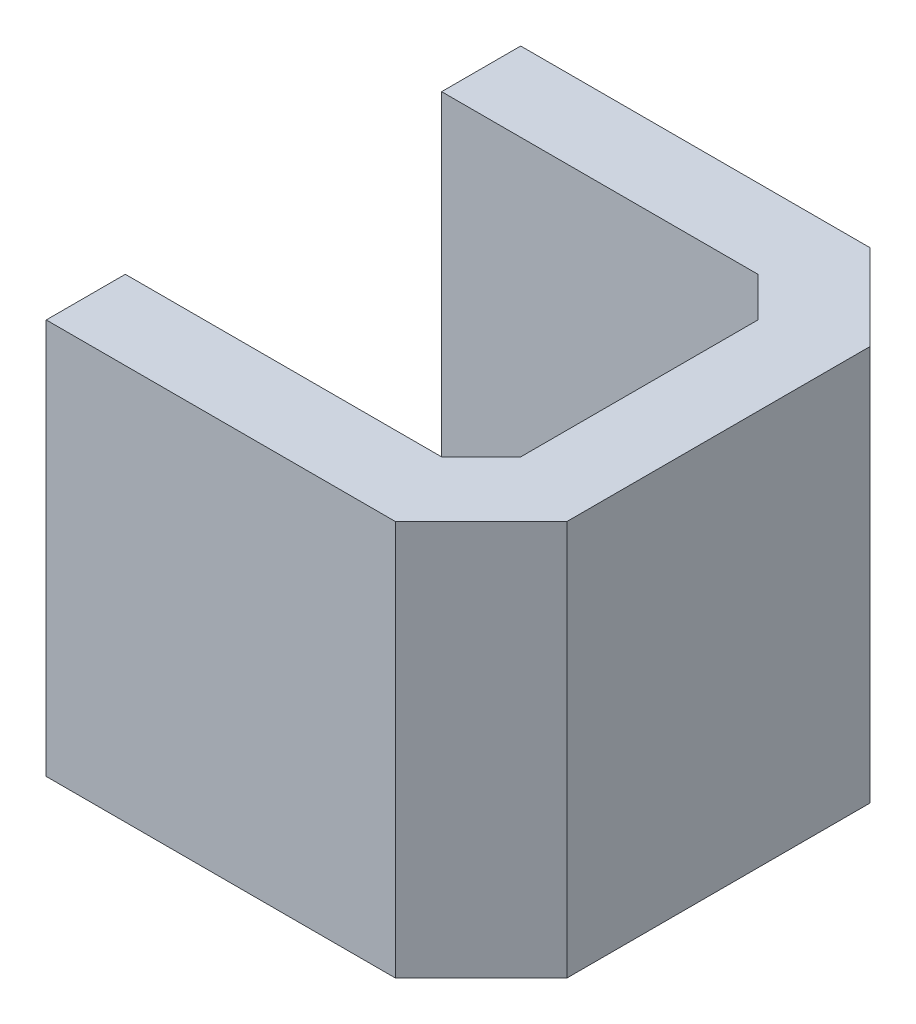
ISO-10303-21;
HEADER;
FILE_DESCRIPTION(('STEP AP214'),'2;1');
FILE_NAME('part.step','',(''),(''),'','','');
FILE_SCHEMA(('AUTOMOTIVE_DESIGN { 1 0 10303 214 1 1 1 1 }'));
ENDSEC;
DATA;
#1=APPLICATION_CONTEXT('core data for automotive mechanical design processes');
#2=APPLICATION_PROTOCOL_DEFINITION('international standard','automotive_design',2000,#1);
#3=PRODUCT_CONTEXT('',#1,'mechanical');
#4=PRODUCT('Part','Part','',(#3));
#5=PRODUCT_RELATED_PRODUCT_CATEGORY('part','',(#4));
#6=PRODUCT_DEFINITION_FORMATION('','',#4);
#7=PRODUCT_DEFINITION_CONTEXT('part definition',#1,'design');
#8=PRODUCT_DEFINITION('design','',#6,#7);
#9=PRODUCT_DEFINITION_SHAPE('','',#8);
#10=(LENGTH_UNIT() NAMED_UNIT(*) SI_UNIT(.MILLI.,.METRE.));
#11=(NAMED_UNIT(*) PLANE_ANGLE_UNIT() SI_UNIT($,.RADIAN.));
#12=(NAMED_UNIT(*) SI_UNIT($,.STERADIAN.) SOLID_ANGLE_UNIT());
#13=UNCERTAINTY_MEASURE_WITH_UNIT(LENGTH_MEASURE(1.E-05),#10,'distance_accuracy_value','');
#14=(GEOMETRIC_REPRESENTATION_CONTEXT(3) GLOBAL_UNCERTAINTY_ASSIGNED_CONTEXT((#13)) GLOBAL_UNIT_ASSIGNED_CONTEXT((#10,
#11,#12)) REPRESENTATION_CONTEXT('',''));
#15=CARTESIAN_POINT('',(0.,0.,0.));
#16=DIRECTION('',(0.,0.,1.));
#17=DIRECTION('',(1.,0.,0.));
#18=AXIS2_PLACEMENT_3D('',#15,#16,#17);
#19=CARTESIAN_POINT('',(5.,10.,3.));
#20=DIRECTION('',(0.707106781186548,0.,0.707106781186547));
#21=DIRECTION('',(0.707106781186547,0.,-0.707106781186548));
#22=AXIS2_PLACEMENT_3D('',#19,#20,#21);
#23=PLANE('',#22);
#24=DIRECTION('',(-0.707106781186547,0.,0.707106781186548));
#25=VECTOR('',#24,1.);
#26=CARTESIAN_POINT('',(5.,0.,3.));
#27=LINE('',#26,#25);
#28=CARTESIAN_POINT('',(5.,0.,3.));
#29=VERTEX_POINT('',#28);
#30=CARTESIAN_POINT('',(4.,0.,4.));
#31=VERTEX_POINT('',#30);
#32=EDGE_CURVE('E164',#29,#31,#27,.T.);
#33=ORIENTED_EDGE('',*,*,#32,.T.);
#34=DIRECTION('',(0.,-1.,0.));
#35=VECTOR('',#34,1.);
#36=CARTESIAN_POINT('',(4.,10.,4.));
#37=LINE('',#36,#35);
#38=CARTESIAN_POINT('',(4.,10.,4.));
#39=VERTEX_POINT('',#38);
#40=EDGE_CURVE('E11',#39,#31,#37,.T.);
#41=ORIENTED_EDGE('',*,*,#40,.F.);
#42=DIRECTION('',(-0.707106781186547,0.,0.707106781186548));
#43=VECTOR('',#42,1.);
#44=CARTESIAN_POINT('',(5.,10.,3.));
#45=LINE('',#44,#43);
#46=CARTESIAN_POINT('',(5.,10.,3.));
#47=VERTEX_POINT('',#46);
#48=EDGE_CURVE('E198',#47,#39,#45,.T.);
#49=ORIENTED_EDGE('',*,*,#48,.F.);
#50=DIRECTION('',(0.,-1.,0.));
#51=VECTOR('',#50,1.);
#52=CARTESIAN_POINT('',(5.,10.,3.));
#53=LINE('',#52,#51);
#54=EDGE_CURVE('E160',#47,#29,#53,.T.);
#55=ORIENTED_EDGE('',*,*,#54,.T.);
#56=EDGE_LOOP('',(#33,#41,#49,#55));
#57=FACE_BOUND('',#56,.T.);
#58=ADVANCED_FACE('F39',(#57),#23,.F.);
#59=CARTESIAN_POINT('',(-4.,10.,4.));
#60=DIRECTION('',(0.,0.,1.));
#61=DIRECTION('',(1.,0.,0.));
#62=AXIS2_PLACEMENT_3D('',#59,#60,#61);
#63=PLANE('',#62);
#64=DIRECTION('',(-1.,0.,0.));
#65=VECTOR('',#64,1.);
#66=CARTESIAN_POINT('',(-4.,0.,4.));
#67=LINE('',#66,#65);
#68=CARTESIAN_POINT('',(-4.,0.,4.));
#69=VERTEX_POINT('',#68);
#70=EDGE_CURVE('E168',#31,#69,#67,.T.);
#71=ORIENTED_EDGE('',*,*,#70,.T.);
#72=DIRECTION('',(0.,-1.,0.));
#73=VECTOR('',#72,1.);
#74=CARTESIAN_POINT('',(-4.,10.,4.));
#75=LINE('',#74,#73);
#76=CARTESIAN_POINT('',(-4.,10.,4.));
#77=VERTEX_POINT('',#76);
#78=EDGE_CURVE('E48',#77,#69,#75,.T.);
#79=ORIENTED_EDGE('',*,*,#78,.F.);
#80=DIRECTION('',(-1.,0.,0.));
#81=VECTOR('',#80,1.);
#82=CARTESIAN_POINT('',(-4.,10.,4.));
#83=LINE('',#82,#81);
#84=EDGE_CURVE('E111',#39,#77,#83,.T.);
#85=ORIENTED_EDGE('',*,*,#84,.F.);
#86=ORIENTED_EDGE('',*,*,#40,.T.);
#87=EDGE_LOOP('',(#71,#79,#85,#86));
#88=FACE_BOUND('',#87,.T.);
#89=ADVANCED_FACE('F292',(#88),#63,.F.);
#90=CARTESIAN_POINT('',(-4.,10.,4.));
#91=DIRECTION('',(1.,0.,0.));
#92=DIRECTION('',(0.,0.,-1.));
#93=AXIS2_PLACEMENT_3D('',#90,#91,#92);
#94=PLANE('',#93);
#95=DIRECTION('',(0.,0.,1.));
#96=VECTOR('',#95,1.);
#97=CARTESIAN_POINT('',(-4.,0.,4.));
#98=LINE('',#97,#96);
#99=CARTESIAN_POINT('',(-4.,0.,6.));
#100=VERTEX_POINT('',#99);
#101=EDGE_CURVE('E171',#69,#100,#98,.T.);
#102=ORIENTED_EDGE('',*,*,#101,.T.);
#103=DIRECTION('',(0.,-1.,0.));
#104=VECTOR('',#103,1.);
#105=CARTESIAN_POINT('',(-4.,10.,6.));
#106=LINE('',#105,#104);
#107=CARTESIAN_POINT('',(-4.,10.,6.));
#108=VERTEX_POINT('',#107);
#109=EDGE_CURVE('E225',#108,#100,#106,.T.);
#110=ORIENTED_EDGE('',*,*,#109,.F.);
#111=DIRECTION('',(0.,0.,1.));
#112=VECTOR('',#111,1.);
#113=CARTESIAN_POINT('',(-4.,10.,4.));
#114=LINE('',#113,#112);
#115=EDGE_CURVE('E235',#77,#108,#114,.T.);
#116=ORIENTED_EDGE('',*,*,#115,.F.);
#117=ORIENTED_EDGE('',*,*,#78,.T.);
#118=EDGE_LOOP('',(#102,#110,#116,#117));
#119=FACE_BOUND('',#118,.T.);
#120=ADVANCED_FACE('F233',(#119),#94,.F.);
#121=CARTESIAN_POINT('',(-4.,10.,6.));
#122=DIRECTION('',(0.,0.,-1.));
#123=DIRECTION('',(-1.,0.,0.));
#124=AXIS2_PLACEMENT_3D('',#121,#122,#123);
#125=PLANE('',#124);
#126=DIRECTION('',(1.,0.,0.));
#127=VECTOR('',#126,1.);
#128=CARTESIAN_POINT('',(-4.,0.,6.));
#129=LINE('',#128,#127);
#130=CARTESIAN_POINT('',(4.82842712474619,0.,6.));
#131=VERTEX_POINT('',#130);
#132=EDGE_CURVE('E174',#100,#131,#129,.T.);
#133=ORIENTED_EDGE('',*,*,#132,.T.);
#134=DIRECTION('',(0.,-1.,0.));
#135=VECTOR('',#134,1.);
#136=CARTESIAN_POINT('',(4.82842712474619,10.,6.));
#137=LINE('',#136,#135);
#138=CARTESIAN_POINT('',(4.82842712474619,10.,6.));
#139=VERTEX_POINT('',#138);
#140=EDGE_CURVE('E221',#139,#131,#137,.T.);
#141=ORIENTED_EDGE('',*,*,#140,.F.);
#142=DIRECTION('',(1.,0.,0.));
#143=VECTOR('',#142,1.);
#144=CARTESIAN_POINT('',(-4.,10.,6.));
#145=LINE('',#144,#143);
#146=EDGE_CURVE('E254',#108,#139,#145,.T.);
#147=ORIENTED_EDGE('',*,*,#146,.F.);
#148=ORIENTED_EDGE('',*,*,#109,.T.);
#149=EDGE_LOOP('',(#133,#141,#147,#148));
#150=FACE_BOUND('',#149,.T.);
#151=ADVANCED_FACE('F244',(#150),#125,.F.);
#152=CARTESIAN_POINT('',(7.,10.,3.82842712474619));
#153=DIRECTION('',(-0.707106781186548,0.,-0.707106781186547));
#154=DIRECTION('',(-0.707106781186547,0.,0.707106781186548));
#155=AXIS2_PLACEMENT_3D('',#152,#153,#154);
#156=PLANE('',#155);
#157=DIRECTION('',(0.707106781186547,0.,-0.707106781186548));
#158=VECTOR('',#157,1.);
#159=CARTESIAN_POINT('',(7.,0.,3.82842712474619));
#160=LINE('',#159,#158);
#161=CARTESIAN_POINT('',(7.,0.,3.82842712474619));
#162=VERTEX_POINT('',#161);
#163=EDGE_CURVE('E177',#131,#162,#160,.T.);
#164=ORIENTED_EDGE('',*,*,#163,.T.);
#165=DIRECTION('',(0.,-1.,0.));
#166=VECTOR('',#165,1.);
#167=CARTESIAN_POINT('',(7.,10.,3.82842712474619));
#168=LINE('',#167,#166);
#169=CARTESIAN_POINT('',(7.,10.,3.82842712474619));
#170=VERTEX_POINT('',#169);
#171=EDGE_CURVE('E217',#170,#162,#168,.T.);
#172=ORIENTED_EDGE('',*,*,#171,.F.);
#173=DIRECTION('',(0.707106781186547,0.,-0.707106781186548));
#174=VECTOR('',#173,1.);
#175=CARTESIAN_POINT('',(7.,10.,3.82842712474619));
#176=LINE('',#175,#174);
#177=EDGE_CURVE('E250',#139,#170,#176,.T.);
#178=ORIENTED_EDGE('',*,*,#177,.F.);
#179=ORIENTED_EDGE('',*,*,#140,.T.);
#180=EDGE_LOOP('',(#164,#172,#178,#179));
#181=FACE_BOUND('',#180,.T.);
#182=ADVANCED_FACE('F248',(#181),#156,.F.);
#183=CARTESIAN_POINT('',(7.,10.,-3.82842712474619));
#184=DIRECTION('',(-1.,0.,0.));
#185=DIRECTION('',(0.,0.,1.));
#186=AXIS2_PLACEMENT_3D('',#183,#184,#185);
#187=PLANE('',#186);
#188=DIRECTION('',(0.,0.,-1.));
#189=VECTOR('',#188,1.);
#190=CARTESIAN_POINT('',(7.,0.,-3.82842712474619));
#191=LINE('',#190,#189);
#192=CARTESIAN_POINT('',(7.,0.,-3.82842712474619));
#193=VERTEX_POINT('',#192);
#194=EDGE_CURVE('E180',#162,#193,#191,.T.);
#195=ORIENTED_EDGE('',*,*,#194,.T.);
#196=DIRECTION('',(0.,-1.,0.));
#197=VECTOR('',#196,1.);
#198=CARTESIAN_POINT('',(7.,10.,-3.82842712474619));
#199=LINE('',#198,#197);
#200=CARTESIAN_POINT('',(7.,10.,-3.82842712474619));
#201=VERTEX_POINT('',#200);
#202=EDGE_CURVE('E213',#201,#193,#199,.T.);
#203=ORIENTED_EDGE('',*,*,#202,.F.);
#204=DIRECTION('',(0.,0.,-1.));
#205=VECTOR('',#204,1.);
#206=CARTESIAN_POINT('',(7.,10.,-3.82842712474619));
#207=LINE('',#206,#205);
#208=EDGE_CURVE('E253',#170,#201,#207,.T.);
#209=ORIENTED_EDGE('',*,*,#208,.F.);
#210=ORIENTED_EDGE('',*,*,#171,.T.);
#211=EDGE_LOOP('',(#195,#203,#209,#210));
#212=FACE_BOUND('',#211,.T.);
#213=ADVANCED_FACE('F305',(#212),#187,.F.);
#214=CARTESIAN_POINT('',(4.82842712474619,10.,-6.));
#215=DIRECTION('',(-0.707106781186546,0.,0.707106781186549));
#216=DIRECTION('',(0.707106781186549,0.,0.707106781186546));
#217=AXIS2_PLACEMENT_3D('',#214,#215,#216);
#218=PLANE('',#217);
#219=DIRECTION('',(-0.707106781186549,0.,-0.707106781186546));
#220=VECTOR('',#219,1.);
#221=CARTESIAN_POINT('',(4.82842712474619,0.,-6.));
#222=LINE('',#221,#220);
#223=CARTESIAN_POINT('',(4.82842712474619,0.,-6.));
#224=VERTEX_POINT('',#223);
#225=EDGE_CURVE('E183',#193,#224,#222,.T.);
#226=ORIENTED_EDGE('',*,*,#225,.T.);
#227=DIRECTION('',(0.,-1.,0.));
#228=VECTOR('',#227,1.);
#229=CARTESIAN_POINT('',(4.82842712474619,10.,-6.));
#230=LINE('',#229,#228);
#231=CARTESIAN_POINT('',(4.82842712474619,10.,-6.));
#232=VERTEX_POINT('',#231);
#233=EDGE_CURVE('E209',#232,#224,#230,.T.);
#234=ORIENTED_EDGE('',*,*,#233,.F.);
#235=DIRECTION('',(-0.707106781186549,0.,-0.707106781186546));
#236=VECTOR('',#235,1.);
#237=CARTESIAN_POINT('',(4.82842712474619,10.,-6.));
#238=LINE('',#237,#236);
#239=EDGE_CURVE('E258',#201,#232,#238,.T.);
#240=ORIENTED_EDGE('',*,*,#239,.F.);
#241=ORIENTED_EDGE('',*,*,#202,.T.);
#242=EDGE_LOOP('',(#226,#234,#240,#241));
#243=FACE_BOUND('',#242,.T.);
#244=ADVANCED_FACE('F308',(#243),#218,.F.);
#245=CARTESIAN_POINT('',(-4.,10.,-6.));
#246=DIRECTION('',(0.,0.,1.));
#247=DIRECTION('',(1.,0.,0.));
#248=AXIS2_PLACEMENT_3D('',#245,#246,#247);
#249=PLANE('',#248);
#250=DIRECTION('',(-1.,0.,0.));
#251=VECTOR('',#250,1.);
#252=CARTESIAN_POINT('',(-4.,0.,-6.));
#253=LINE('',#252,#251);
#254=CARTESIAN_POINT('',(-4.,0.,-6.));
#255=VERTEX_POINT('',#254);
#256=EDGE_CURVE('E186',#224,#255,#253,.T.);
#257=ORIENTED_EDGE('',*,*,#256,.T.);
#258=DIRECTION('',(0.,-1.,0.));
#259=VECTOR('',#258,1.);
#260=CARTESIAN_POINT('',(-4.,10.,-6.));
#261=LINE('',#260,#259);
#262=CARTESIAN_POINT('',(-4.,10.,-6.));
#263=VERTEX_POINT('',#262);
#264=EDGE_CURVE('E205',#263,#255,#261,.T.);
#265=ORIENTED_EDGE('',*,*,#264,.F.);
#266=DIRECTION('',(-1.,0.,0.));
#267=VECTOR('',#266,1.);
#268=CARTESIAN_POINT('',(-4.,10.,-6.));
#269=LINE('',#268,#267);
#270=EDGE_CURVE('E265',#232,#263,#269,.T.);
#271=ORIENTED_EDGE('',*,*,#270,.F.);
#272=ORIENTED_EDGE('',*,*,#233,.T.);
#273=EDGE_LOOP('',(#257,#265,#271,#272));
#274=FACE_BOUND('',#273,.T.);
#275=ADVANCED_FACE('F273',(#274),#249,.F.);
#276=CARTESIAN_POINT('',(-4.,10.,-4.));
#277=DIRECTION('',(1.,0.,0.));
#278=DIRECTION('',(0.,0.,-1.));
#279=AXIS2_PLACEMENT_3D('',#276,#277,#278);
#280=PLANE('',#279);
#281=DIRECTION('',(0.,0.,1.));
#282=VECTOR('',#281,1.);
#283=CARTESIAN_POINT('',(-4.,0.,-4.));
#284=LINE('',#283,#282);
#285=CARTESIAN_POINT('',(-4.,0.,-4.));
#286=VERTEX_POINT('',#285);
#287=EDGE_CURVE('E189',#255,#286,#284,.T.);
#288=ORIENTED_EDGE('',*,*,#287,.T.);
#289=DIRECTION('',(0.,-1.,0.));
#290=VECTOR('',#289,1.);
#291=CARTESIAN_POINT('',(-4.,10.,-4.));
#292=LINE('',#291,#290);
#293=CARTESIAN_POINT('',(-4.,10.,-4.));
#294=VERTEX_POINT('',#293);
#295=EDGE_CURVE('E153',#294,#286,#292,.T.);
#296=ORIENTED_EDGE('',*,*,#295,.F.);
#297=DIRECTION('',(0.,0.,1.));
#298=VECTOR('',#297,1.);
#299=CARTESIAN_POINT('',(-4.,10.,-4.));
#300=LINE('',#299,#298);
#301=EDGE_CURVE('E142',#263,#294,#300,.T.);
#302=ORIENTED_EDGE('',*,*,#301,.F.);
#303=ORIENTED_EDGE('',*,*,#264,.T.);
#304=EDGE_LOOP('',(#288,#296,#302,#303));
#305=FACE_BOUND('',#304,.T.);
#306=ADVANCED_FACE('F277',(#305),#280,.F.);
#307=CARTESIAN_POINT('',(-4.,10.,-4.));
#308=DIRECTION('',(0.,0.,-1.));
#309=DIRECTION('',(-1.,0.,0.));
#310=AXIS2_PLACEMENT_3D('',#307,#308,#309);
#311=PLANE('',#310);
#312=DIRECTION('',(1.,0.,0.));
#313=VECTOR('',#312,1.);
#314=CARTESIAN_POINT('',(-4.,0.,-4.));
#315=LINE('',#314,#313);
#316=CARTESIAN_POINT('',(4.,0.,-4.));
#317=VERTEX_POINT('',#316);
#318=EDGE_CURVE('E151',#286,#317,#315,.T.);
#319=ORIENTED_EDGE('',*,*,#318,.T.);
#320=DIRECTION('',(0.,-1.,0.));
#321=VECTOR('',#320,1.);
#322=CARTESIAN_POINT('',(4.,10.,-4.));
#323=LINE('',#322,#321);
#324=CARTESIAN_POINT('',(4.,10.,-4.));
#325=VERTEX_POINT('',#324);
#326=EDGE_CURVE('E148',#325,#317,#323,.T.);
#327=ORIENTED_EDGE('',*,*,#326,.F.);
#328=DIRECTION('',(1.,0.,0.));
#329=VECTOR('',#328,1.);
#330=CARTESIAN_POINT('',(-4.,10.,-4.));
#331=LINE('',#330,#329);
#332=EDGE_CURVE('E136',#294,#325,#331,.T.);
#333=ORIENTED_EDGE('',*,*,#332,.F.);
#334=ORIENTED_EDGE('',*,*,#295,.T.);
#335=EDGE_LOOP('',(#319,#327,#333,#334));
#336=FACE_BOUND('',#335,.T.);
#337=ADVANCED_FACE('F149',(#336),#311,.F.);
#338=CARTESIAN_POINT('',(4.,10.,-4.));
#339=DIRECTION('',(0.707106781186546,0.,-0.707106781186549));
#340=DIRECTION('',(-0.707106781186549,0.,-0.707106781186546));
#341=AXIS2_PLACEMENT_3D('',#338,#339,#340);
#342=PLANE('',#341);
#343=DIRECTION('',(0.707106781186549,0.,0.707106781186546));
#344=VECTOR('',#343,1.);
#345=CARTESIAN_POINT('',(4.,0.,-4.));
#346=LINE('',#345,#344);
#347=CARTESIAN_POINT('',(5.,0.,-3.));
#348=VERTEX_POINT('',#347);
#349=EDGE_CURVE('E97',#317,#348,#346,.T.);
#350=ORIENTED_EDGE('',*,*,#349,.T.);
#351=DIRECTION('',(0.,-1.,0.));
#352=VECTOR('',#351,1.);
#353=CARTESIAN_POINT('',(5.,10.,-3.));
#354=LINE('',#353,#352);
#355=CARTESIAN_POINT('',(5.,10.,-3.));
#356=VERTEX_POINT('',#355);
#357=EDGE_CURVE('E154',#356,#348,#354,.T.);
#358=ORIENTED_EDGE('',*,*,#357,.F.);
#359=DIRECTION('',(0.707106781186549,0.,0.707106781186546));
#360=VECTOR('',#359,1.);
#361=CARTESIAN_POINT('',(4.,10.,-4.));
#362=LINE('',#361,#360);
#363=EDGE_CURVE('E140',#325,#356,#362,.T.);
#364=ORIENTED_EDGE('',*,*,#363,.F.);
#365=ORIENTED_EDGE('',*,*,#326,.T.);
#366=EDGE_LOOP('',(#350,#358,#364,#365));
#367=FACE_BOUND('',#366,.T.);
#368=ADVANCED_FACE('F156',(#367),#342,.F.);
#369=CARTESIAN_POINT('',(5.,10.,-3.));
#370=DIRECTION('',(1.,0.,0.));
#371=DIRECTION('',(0.,0.,-1.));
#372=AXIS2_PLACEMENT_3D('',#369,#370,#371);
#373=PLANE('',#372);
#374=DIRECTION('',(0.,0.,1.));
#375=VECTOR('',#374,1.);
#376=CARTESIAN_POINT('',(5.,0.,-3.));
#377=LINE('',#376,#375);
#378=EDGE_CURVE('E103',#348,#29,#377,.T.);
#379=ORIENTED_EDGE('',*,*,#378,.T.);
#380=ORIENTED_EDGE('',*,*,#54,.F.);
#381=DIRECTION('',(0.,0.,1.));
#382=VECTOR('',#381,1.);
#383=CARTESIAN_POINT('',(5.,10.,-3.));
#384=LINE('',#383,#382);
#385=EDGE_CURVE('E56',#356,#47,#384,.T.);
#386=ORIENTED_EDGE('',*,*,#385,.F.);
#387=ORIENTED_EDGE('',*,*,#357,.T.);
#388=EDGE_LOOP('',(#379,#380,#386,#387));
#389=FACE_BOUND('',#388,.T.);
#390=ADVANCED_FACE('F281',(#389),#373,.F.);
#391=CARTESIAN_POINT('',(0.,10.,0.));
#392=DIRECTION('',(0.,1.,0.));
#393=DIRECTION('',(0.,0.,1.));
#394=AXIS2_PLACEMENT_3D('',#391,#392,#393);
#395=PLANE('',#394);
#396=ORIENTED_EDGE('',*,*,#48,.T.);
#397=ORIENTED_EDGE('',*,*,#84,.T.);
#398=ORIENTED_EDGE('',*,*,#115,.T.);
#399=ORIENTED_EDGE('',*,*,#146,.T.);
#400=ORIENTED_EDGE('',*,*,#177,.T.);
#401=ORIENTED_EDGE('',*,*,#208,.T.);
#402=ORIENTED_EDGE('',*,*,#239,.T.);
#403=ORIENTED_EDGE('',*,*,#270,.T.);
#404=ORIENTED_EDGE('',*,*,#301,.T.);
#405=ORIENTED_EDGE('',*,*,#332,.T.);
#406=ORIENTED_EDGE('',*,*,#363,.T.);
#407=ORIENTED_EDGE('',*,*,#385,.T.);
#408=EDGE_LOOP('',(#396,#397,#398,#399,#400,#401,#402,#403,#404,#405,#406,#407));
#409=FACE_BOUND('',#408,.T.);
#410=ADVANCED_FACE('F138',(#409),#395,.T.);
#411=CARTESIAN_POINT('',(0.,0.,0.));
#412=DIRECTION('',(0.,1.,0.));
#413=DIRECTION('',(0.,0.,1.));
#414=AXIS2_PLACEMENT_3D('',#411,#412,#413);
#415=PLANE('',#414);
#416=ORIENTED_EDGE('',*,*,#32,.F.);
#417=ORIENTED_EDGE('',*,*,#378,.F.);
#418=ORIENTED_EDGE('',*,*,#349,.F.);
#419=ORIENTED_EDGE('',*,*,#318,.F.);
#420=ORIENTED_EDGE('',*,*,#287,.F.);
#421=ORIENTED_EDGE('',*,*,#256,.F.);
#422=ORIENTED_EDGE('',*,*,#225,.F.);
#423=ORIENTED_EDGE('',*,*,#194,.F.);
#424=ORIENTED_EDGE('',*,*,#163,.F.);
#425=ORIENTED_EDGE('',*,*,#132,.F.);
#426=ORIENTED_EDGE('',*,*,#101,.F.);
#427=ORIENTED_EDGE('',*,*,#70,.F.);
#428=EDGE_LOOP('',(#416,#417,#418,#419,#420,#421,#422,#423,#424,#425,#426,#427));
#429=FACE_BOUND('',#428,.T.);
#430=ADVANCED_FACE('F239',(#429),#415,.F.);
#431=CLOSED_SHELL('',(#58,#89,#120,#151,#182,#213,#244,#275,#306,#337,#368,#390,#410,#430));
#432=MANIFOLD_SOLID_BREP('B2',#431);
#433=ADVANCED_BREP_SHAPE_REPRESENTATION('',(#18,#432),#14);
#434=SHAPE_DEFINITION_REPRESENTATION(#9,#433);
ENDSEC;
END-ISO-10303-21;
